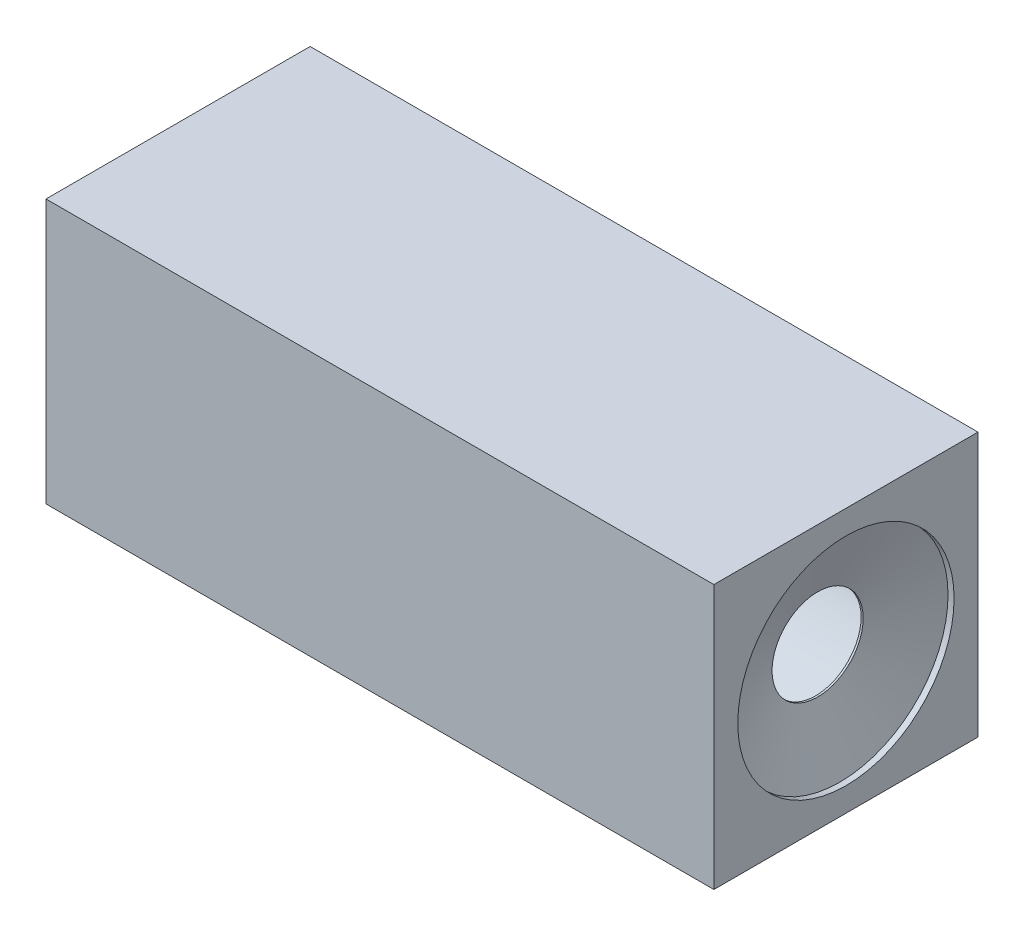
ISO-10303-21;
HEADER;
FILE_DESCRIPTION(('STEP AP214'),'2;1');
FILE_NAME('part.step','',(''),(''),'','','');
FILE_SCHEMA(('AUTOMOTIVE_DESIGN { 1 0 10303 214 1 1 1 1 }'));
ENDSEC;
DATA;
#1=APPLICATION_CONTEXT('core data for automotive mechanical design processes');
#2=APPLICATION_PROTOCOL_DEFINITION('international standard','automotive_design',2000,#1);
#3=PRODUCT_CONTEXT('',#1,'mechanical');
#4=PRODUCT('Part','Part','',(#3));
#5=PRODUCT_RELATED_PRODUCT_CATEGORY('part','',(#4));
#6=PRODUCT_DEFINITION_FORMATION('','',#4);
#7=PRODUCT_DEFINITION_CONTEXT('part definition',#1,'design');
#8=PRODUCT_DEFINITION('design','',#6,#7);
#9=PRODUCT_DEFINITION_SHAPE('','',#8);
#10=(LENGTH_UNIT() NAMED_UNIT(*) SI_UNIT(.MILLI.,.METRE.));
#11=(NAMED_UNIT(*) PLANE_ANGLE_UNIT() SI_UNIT($,.RADIAN.));
#12=(NAMED_UNIT(*) SI_UNIT($,.STERADIAN.) SOLID_ANGLE_UNIT());
#13=UNCERTAINTY_MEASURE_WITH_UNIT(LENGTH_MEASURE(1.E-05),#10,'distance_accuracy_value','');
#14=(GEOMETRIC_REPRESENTATION_CONTEXT(3) GLOBAL_UNCERTAINTY_ASSIGNED_CONTEXT((#13)) GLOBAL_UNIT_ASSIGNED_CONTEXT((#10,
#11,#12)) REPRESENTATION_CONTEXT('',''));
#15=CARTESIAN_POINT('',(0.,0.,0.));
#16=DIRECTION('',(0.,0.,1.));
#17=DIRECTION('',(1.,0.,0.));
#18=AXIS2_PLACEMENT_3D('',#15,#16,#17);
#19=CARTESIAN_POINT('',(330.,0.,0.));
#20=DIRECTION('',(1.,0.,0.));
#21=DIRECTION('',(0.,0.,-1.));
#22=AXIS2_PLACEMENT_3D('',#19,#20,#21);
#23=PLANE('',#22);
#24=DIRECTION('',(0.,1.,0.));
#25=VECTOR('',#24,1.);
#26=CARTESIAN_POINT('',(330.,65.25,-65.25));
#27=LINE('',#26,#25);
#28=CARTESIAN_POINT('',(330.,-65.25,-65.25));
#29=VERTEX_POINT('',#28);
#30=CARTESIAN_POINT('',(330.,65.25,-65.25));
#31=VERTEX_POINT('',#30);
#32=EDGE_CURVE('E87',#29,#31,#27,.T.);
#33=ORIENTED_EDGE('',*,*,#32,.T.);
#34=DIRECTION('',(0.,0.,1.));
#35=VECTOR('',#34,1.);
#36=CARTESIAN_POINT('',(330.,65.25,65.25));
#37=LINE('',#36,#35);
#38=CARTESIAN_POINT('',(330.,65.25,65.25));
#39=VERTEX_POINT('',#38);
#40=EDGE_CURVE('E82',#31,#39,#37,.T.);
#41=ORIENTED_EDGE('',*,*,#40,.T.);
#42=DIRECTION('',(0.,-1.,0.));
#43=VECTOR('',#42,1.);
#44=CARTESIAN_POINT('',(330.,65.25,65.25));
#45=LINE('',#44,#43);
#46=CARTESIAN_POINT('',(330.,-65.25,65.25));
#47=VERTEX_POINT('',#46);
#48=EDGE_CURVE('E85',#39,#47,#45,.T.);
#49=ORIENTED_EDGE('',*,*,#48,.T.);
#50=DIRECTION('',(0.,0.,-1.));
#51=VECTOR('',#50,1.);
#52=CARTESIAN_POINT('',(330.,-65.25,65.25));
#53=LINE('',#52,#51);
#54=EDGE_CURVE('E52',#47,#29,#53,.T.);
#55=ORIENTED_EDGE('',*,*,#54,.T.);
#56=EDGE_LOOP('',(#33,#41,#49,#55));
#57=FACE_BOUND('',#56,.T.);
#58=CARTESIAN_POINT('',(330.,0.,0.));
#59=DIRECTION('',(1.,0.,0.));
#60=DIRECTION('',(0.,0.,-1.));
#61=AXIS2_PLACEMENT_3D('',#58,#59,#60);
#62=CIRCLE('',#61,53.439293368103);
#63=CARTESIAN_POINT('',(330.,0.,-53.439293368103));
#64=VERTEX_POINT('',#63);
#65=EDGE_CURVE('E116',#64,#64,#62,.T.);
#66=ORIENTED_EDGE('',*,*,#65,.F.);
#67=EDGE_LOOP('',(#66));
#68=FACE_BOUND('',#67,.T.);
#69=ADVANCED_FACE('F35',(#57,#68),#23,.T.);
#70=CARTESIAN_POINT('',(315.,0.,0.));
#71=DIRECTION('',(-1.,0.,0.));
#72=DIRECTION('',(0.,0.,1.));
#73=AXIS2_PLACEMENT_3D('',#70,#71,#72);
#74=PLANE('',#73);
#75=CARTESIAN_POINT('',(315.,0.,0.));
#76=DIRECTION('',(-1.,0.,0.));
#77=DIRECTION('',(0.,0.,1.));
#78=AXIS2_PLACEMENT_3D('',#75,#76,#77);
#79=CIRCLE('',#78,56.25);
#80=CARTESIAN_POINT('',(315.,0.,56.25));
#81=VERTEX_POINT('',#80);
#82=EDGE_CURVE('E102',#81,#81,#79,.T.);
#83=ORIENTED_EDGE('',*,*,#82,.T.);
#84=EDGE_LOOP('',(#83));
#85=FACE_BOUND('',#84,.T.);
#86=CARTESIAN_POINT('',(315.,0.,0.));
#87=DIRECTION('',(1.,0.,0.));
#88=DIRECTION('',(0.,0.,-1.));
#89=AXIS2_PLACEMENT_3D('',#86,#87,#88);
#90=CIRCLE('',#89,22.5);
#91=CARTESIAN_POINT('',(315.,0.,-22.5));
#92=VERTEX_POINT('',#91);
#93=EDGE_CURVE('E127',#92,#92,#90,.T.);
#94=ORIENTED_EDGE('',*,*,#93,.T.);
#95=EDGE_LOOP('',(#94));
#96=FACE_BOUND('',#95,.T.);
#97=ADVANCED_FACE('F131',(#85,#96),#74,.T.);
#98=CARTESIAN_POINT('',(330.,65.25,-65.25));
#99=DIRECTION('',(0.,0.,1.));
#100=DIRECTION('',(0.,-1.,0.));
#101=AXIS2_PLACEMENT_3D('',#98,#99,#100);
#102=PLANE('',#101);
#103=DIRECTION('',(0.,1.,0.));
#104=VECTOR('',#103,1.);
#105=CARTESIAN_POINT('',(0.,65.25,-65.25));
#106=LINE('',#105,#104);
#107=CARTESIAN_POINT('',(0.,-65.25,-65.25));
#108=VERTEX_POINT('',#107);
#109=CARTESIAN_POINT('',(0.,65.25,-65.25));
#110=VERTEX_POINT('',#109);
#111=EDGE_CURVE('E99',#108,#110,#106,.T.);
#112=ORIENTED_EDGE('',*,*,#111,.T.);
#113=DIRECTION('',(-1.,0.,0.));
#114=VECTOR('',#113,1.);
#115=CARTESIAN_POINT('',(330.,65.25,-65.25));
#116=LINE('',#115,#114);
#117=EDGE_CURVE('E11',#31,#110,#116,.T.);
#118=ORIENTED_EDGE('',*,*,#117,.F.);
#119=ORIENTED_EDGE('',*,*,#32,.F.);
#120=DIRECTION('',(-1.,0.,0.));
#121=VECTOR('',#120,1.);
#122=CARTESIAN_POINT('',(330.,-65.25,-65.25));
#123=LINE('',#122,#121);
#124=EDGE_CURVE('E95',#29,#108,#123,.T.);
#125=ORIENTED_EDGE('',*,*,#124,.T.);
#126=EDGE_LOOP('',(#112,#118,#119,#125));
#127=FACE_BOUND('',#126,.T.);
#128=ADVANCED_FACE('F37',(#127),#102,.F.);
#129=CARTESIAN_POINT('',(330.,65.25,65.25));
#130=DIRECTION('',(0.,-1.,0.));
#131=DIRECTION('',(0.,0.,-1.));
#132=AXIS2_PLACEMENT_3D('',#129,#130,#131);
#133=PLANE('',#132);
#134=DIRECTION('',(0.,0.,1.));
#135=VECTOR('',#134,1.);
#136=CARTESIAN_POINT('',(0.,65.25,65.25));
#137=LINE('',#136,#135);
#138=CARTESIAN_POINT('',(0.,65.25,65.25));
#139=VERTEX_POINT('',#138);
#140=EDGE_CURVE('E91',#110,#139,#137,.T.);
#141=ORIENTED_EDGE('',*,*,#140,.T.);
#142=DIRECTION('',(-1.,0.,0.));
#143=VECTOR('',#142,1.);
#144=CARTESIAN_POINT('',(330.,65.25,65.25));
#145=LINE('',#144,#143);
#146=EDGE_CURVE('E44',#39,#139,#145,.T.);
#147=ORIENTED_EDGE('',*,*,#146,.F.);
#148=ORIENTED_EDGE('',*,*,#40,.F.);
#149=ORIENTED_EDGE('',*,*,#117,.T.);
#150=EDGE_LOOP('',(#141,#147,#148,#149));
#151=FACE_BOUND('',#150,.T.);
#152=ADVANCED_FACE('F90',(#151),#133,.F.);
#153=CARTESIAN_POINT('',(330.,65.25,65.25));
#154=DIRECTION('',(0.,0.,-1.));
#155=DIRECTION('',(0.,1.,0.));
#156=AXIS2_PLACEMENT_3D('',#153,#154,#155);
#157=PLANE('',#156);
#158=DIRECTION('',(0.,-1.,0.));
#159=VECTOR('',#158,1.);
#160=CARTESIAN_POINT('',(0.,65.25,65.25));
#161=LINE('',#160,#159);
#162=CARTESIAN_POINT('',(0.,-65.25,65.25));
#163=VERTEX_POINT('',#162);
#164=EDGE_CURVE('E69',#139,#163,#161,.T.);
#165=ORIENTED_EDGE('',*,*,#164,.T.);
#166=DIRECTION('',(-1.,0.,0.));
#167=VECTOR('',#166,1.);
#168=CARTESIAN_POINT('',(330.,-65.25,65.25));
#169=LINE('',#168,#167);
#170=EDGE_CURVE('E92',#47,#163,#169,.T.);
#171=ORIENTED_EDGE('',*,*,#170,.F.);
#172=ORIENTED_EDGE('',*,*,#48,.F.);
#173=ORIENTED_EDGE('',*,*,#146,.T.);
#174=EDGE_LOOP('',(#165,#171,#172,#173));
#175=FACE_BOUND('',#174,.T.);
#176=ADVANCED_FACE('F93',(#175),#157,.F.);
#177=CARTESIAN_POINT('',(330.,-65.25,65.25));
#178=DIRECTION('',(0.,1.,0.));
#179=DIRECTION('',(0.,0.,1.));
#180=AXIS2_PLACEMENT_3D('',#177,#178,#179);
#181=PLANE('',#180);
#182=DIRECTION('',(0.,0.,-1.));
#183=VECTOR('',#182,1.);
#184=CARTESIAN_POINT('',(0.,-65.25,65.25));
#185=LINE('',#184,#183);
#186=EDGE_CURVE('E75',#163,#108,#185,.T.);
#187=ORIENTED_EDGE('',*,*,#186,.T.);
#188=ORIENTED_EDGE('',*,*,#124,.F.);
#189=ORIENTED_EDGE('',*,*,#54,.F.);
#190=ORIENTED_EDGE('',*,*,#170,.T.);
#191=EDGE_LOOP('',(#187,#188,#189,#190));
#192=FACE_BOUND('',#191,.T.);
#193=ADVANCED_FACE('F107',(#192),#181,.F.);
#194=CARTESIAN_POINT('',(0.,0.,0.));
#195=DIRECTION('',(1.,0.,0.));
#196=DIRECTION('',(0.,0.,-1.));
#197=AXIS2_PLACEMENT_3D('',#194,#195,#196);
#198=PLANE('',#197);
#199=CARTESIAN_POINT('',(0.,0.,0.));
#200=DIRECTION('',(-1.,0.,0.));
#201=DIRECTION('',(0.,0.,1.));
#202=AXIS2_PLACEMENT_3D('',#199,#200,#201);
#203=CIRCLE('',#202,56.25);
#204=CARTESIAN_POINT('',(0.,0.,56.25));
#205=VERTEX_POINT('',#204);
#206=EDGE_CURVE('E113',#205,#205,#203,.T.);
#207=ORIENTED_EDGE('',*,*,#206,.F.);
#208=EDGE_LOOP('',(#207));
#209=FACE_BOUND('',#208,.T.);
#210=ORIENTED_EDGE('',*,*,#111,.F.);
#211=ORIENTED_EDGE('',*,*,#186,.F.);
#212=ORIENTED_EDGE('',*,*,#164,.F.);
#213=ORIENTED_EDGE('',*,*,#140,.F.);
#214=EDGE_LOOP('',(#210,#211,#212,#213));
#215=FACE_BOUND('',#214,.T.);
#216=ADVANCED_FACE('F110',(#209,#215),#198,.F.);
#217=CARTESIAN_POINT('',(315.,0.,0.));
#218=DIRECTION('',(-1.,0.,0.));
#219=DIRECTION('',(0.,0.,1.));
#220=AXIS2_PLACEMENT_3D('',#217,#218,#219);
#221=CYLINDRICAL_SURFACE('',#220,56.25);
#222=ORIENTED_EDGE('',*,*,#82,.F.);
#223=EDGE_LOOP('',(#222));
#224=FACE_BOUND('',#223,.T.);
#225=ORIENTED_EDGE('',*,*,#206,.T.);
#226=EDGE_LOOP('',(#225));
#227=FACE_BOUND('',#226,.T.);
#228=ADVANCED_FACE('F153',(#224,#227),#221,.F.);
#229=CARTESIAN_POINT('',(315.,0.,0.));
#230=DIRECTION('',(1.,0.,0.));
#231=DIRECTION('',(0.,0.,-1.));
#232=AXIS2_PLACEMENT_3D('',#229,#230,#231);
#233=CYLINDRICAL_SURFACE('',#232,53.439293368103);
#234=ORIENTED_EDGE('',*,*,#65,.T.);
#235=EDGE_LOOP('',(#234));
#236=FACE_BOUND('',#235,.T.);
#237=CARTESIAN_POINT('',(327.,0.,0.));
#238=DIRECTION('',(1.,0.,0.));
#239=DIRECTION('',(0.,0.,-1.));
#240=AXIS2_PLACEMENT_3D('',#237,#238,#239);
#241=CIRCLE('',#240,53.439293368103);
#242=CARTESIAN_POINT('',(327.,0.,-53.439293368103));
#243=VERTEX_POINT('',#242);
#244=EDGE_CURVE('E121',#243,#243,#241,.T.);
#245=ORIENTED_EDGE('',*,*,#244,.F.);
#246=EDGE_LOOP('',(#245));
#247=FACE_BOUND('',#246,.T.);
#248=ADVANCED_FACE('F141',(#236,#247),#233,.F.);
#249=CARTESIAN_POINT('',(316.,0.,0.));
#250=DIRECTION('',(1.,0.,0.));
#251=DIRECTION('',(0.,0.,-1.));
#252=AXIS2_PLACEMENT_3D('',#249,#250,#251);
#253=CONICAL_SURFACE('',#252,22.5,1.22919913269204);
#254=ORIENTED_EDGE('',*,*,#244,.T.);
#255=EDGE_LOOP('',(#254));
#256=FACE_BOUND('',#255,.T.);
#257=CARTESIAN_POINT('',(316.,0.,0.));
#258=DIRECTION('',(1.,0.,0.));
#259=DIRECTION('',(0.,0.,-1.));
#260=AXIS2_PLACEMENT_3D('',#257,#258,#259);
#261=CIRCLE('',#260,22.5);
#262=CARTESIAN_POINT('',(316.,0.,-22.5));
#263=VERTEX_POINT('',#262);
#264=EDGE_CURVE('E124',#263,#263,#261,.T.);
#265=ORIENTED_EDGE('',*,*,#264,.F.);
#266=EDGE_LOOP('',(#265));
#267=FACE_BOUND('',#266,.T.);
#268=ADVANCED_FACE('F135',(#256,#267),#253,.F.);
#269=CARTESIAN_POINT('',(315.,0.,0.));
#270=DIRECTION('',(1.,0.,0.));
#271=DIRECTION('',(0.,0.,-1.));
#272=AXIS2_PLACEMENT_3D('',#269,#270,#271);
#273=CYLINDRICAL_SURFACE('',#272,22.5);
#274=ORIENTED_EDGE('',*,*,#264,.T.);
#275=EDGE_LOOP('',(#274));
#276=FACE_BOUND('',#275,.T.);
#277=ORIENTED_EDGE('',*,*,#93,.F.);
#278=EDGE_LOOP('',(#277));
#279=FACE_BOUND('',#278,.T.);
#280=ADVANCED_FACE('F133',(#276,#279),#273,.F.);
#281=CLOSED_SHELL('',(#69,#97,#128,#152,#176,#193,#216,#228,#248,#268,#280));
#282=MANIFOLD_SOLID_BREP('B2',#281);
#283=ADVANCED_BREP_SHAPE_REPRESENTATION('',(#18,#282),#14);
#284=SHAPE_DEFINITION_REPRESENTATION(#9,#283);
ENDSEC;
END-ISO-10303-21;
